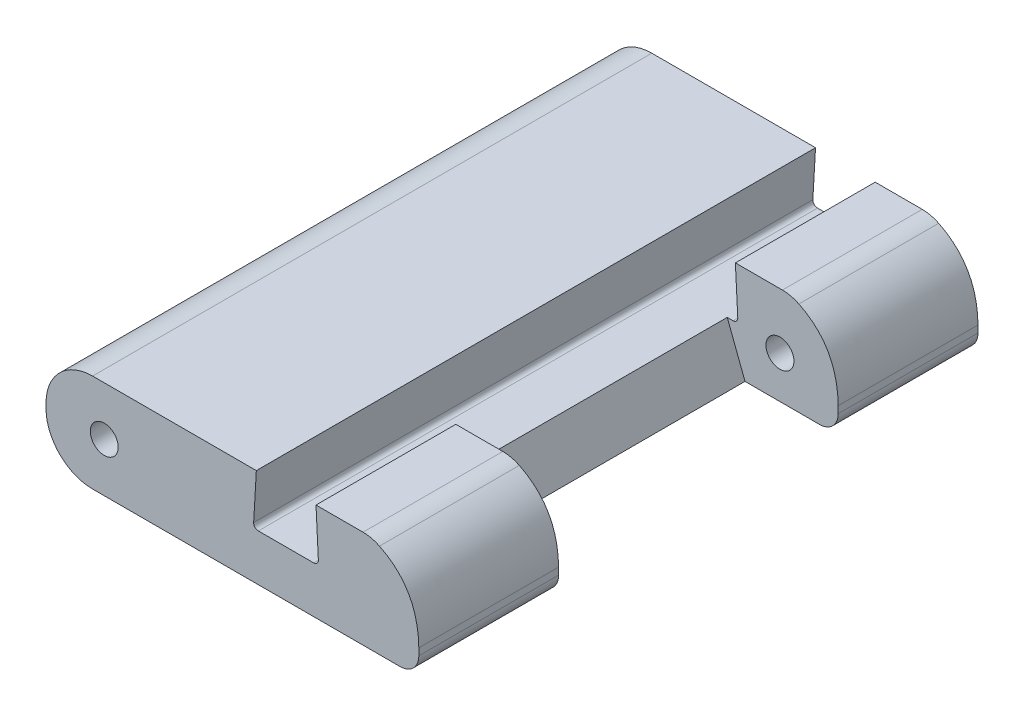
ISO-10303-21;
HEADER;
FILE_DESCRIPTION(('STEP AP214'),'2;1');
FILE_NAME('part.step','',(''),(''),'','','');
FILE_SCHEMA(('AUTOMOTIVE_DESIGN { 1 0 10303 214 1 1 1 1 }'));
ENDSEC;
DATA;
#1=APPLICATION_CONTEXT('core data for automotive mechanical design processes');
#2=APPLICATION_PROTOCOL_DEFINITION('international standard','automotive_design',2000,#1);
#3=PRODUCT_CONTEXT('',#1,'mechanical');
#4=PRODUCT('Part','Part','',(#3));
#5=PRODUCT_RELATED_PRODUCT_CATEGORY('part','',(#4));
#6=PRODUCT_DEFINITION_FORMATION('','',#4);
#7=PRODUCT_DEFINITION_CONTEXT('part definition',#1,'design');
#8=PRODUCT_DEFINITION('design','',#6,#7);
#9=PRODUCT_DEFINITION_SHAPE('','',#8);
#10=(LENGTH_UNIT() NAMED_UNIT(*) SI_UNIT(.MILLI.,.METRE.));
#11=(NAMED_UNIT(*) PLANE_ANGLE_UNIT() SI_UNIT($,.RADIAN.));
#12=(NAMED_UNIT(*) SI_UNIT($,.STERADIAN.) SOLID_ANGLE_UNIT());
#13=UNCERTAINTY_MEASURE_WITH_UNIT(LENGTH_MEASURE(1.E-05),#10,'distance_accuracy_value','');
#14=(GEOMETRIC_REPRESENTATION_CONTEXT(3) GLOBAL_UNCERTAINTY_ASSIGNED_CONTEXT((#13)) GLOBAL_UNIT_ASSIGNED_CONTEXT((#10,
#11,#12)) REPRESENTATION_CONTEXT('',''));
#15=CARTESIAN_POINT('',(0.,0.,0.));
#16=DIRECTION('',(0.,0.,1.));
#17=DIRECTION('',(1.,0.,0.));
#18=AXIS2_PLACEMENT_3D('',#15,#16,#17);
#19=CARTESIAN_POINT('',(0.,2.1,-12.));
#20=DIRECTION('',(0.,-1.,0.));
#21=DIRECTION('',(0.,0.,-1.));
#22=AXIS2_PLACEMENT_3D('',#19,#20,#21);
#23=PLANE('',#22);
#24=DIRECTION('',(1.,0.,0.));
#25=VECTOR('',#24,1.);
#26=CARTESIAN_POINT('',(0.,2.1,0.));
#27=LINE('',#26,#25);
#28=CARTESIAN_POINT('',(5.79368218827693,2.1,0.));
#29=VERTEX_POINT('',#28);
#30=CARTESIAN_POINT('',(6.80312630198546,2.1,0.));
#31=VERTEX_POINT('',#30);
#32=EDGE_CURVE('E324',#29,#31,#27,.T.);
#33=ORIENTED_EDGE('',*,*,#32,.T.);
#34=DIRECTION('',(0.,0.,1.));
#35=VECTOR('',#34,1.);
#36=CARTESIAN_POINT('',(6.80312630198546,2.1,-3.));
#37=LINE('',#36,#35);
#38=CARTESIAN_POINT('',(6.80312630198546,2.1,-3.));
#39=VERTEX_POINT('',#38);
#40=EDGE_CURVE('E418',#31,#39,#37,.F.);
#41=ORIENTED_EDGE('',*,*,#40,.T.);
#42=DIRECTION('',(1.,0.,0.));
#43=VECTOR('',#42,1.);
#44=CARTESIAN_POINT('',(8.,2.1,-3.));
#45=LINE('',#44,#43);
#46=CARTESIAN_POINT('',(5.79368218827693,2.1,-3.));
#47=VERTEX_POINT('',#46);
#48=EDGE_CURVE('E312',#47,#39,#45,.T.);
#49=ORIENTED_EDGE('',*,*,#48,.F.);
#50=DIRECTION('',(0.,0.,1.));
#51=VECTOR('',#50,1.);
#52=CARTESIAN_POINT('',(5.79368218827693,2.1,-12.));
#53=LINE('',#52,#51);
#54=EDGE_CURVE('E343',#47,#29,#53,.T.);
#55=ORIENTED_EDGE('',*,*,#54,.T.);
#56=EDGE_LOOP('',(#33,#41,#49,#55));
#57=FACE_BOUND('',#56,.T.);
#58=ADVANCED_FACE('F30',(#57),#23,.F.);
#59=DIRECTION('',(-1.,0.,0.));
#60=VECTOR('',#59,1.);
#61=CARTESIAN_POINT('',(8.,2.1,-9.));
#62=LINE('',#61,#60);
#63=CARTESIAN_POINT('',(6.80312630198546,2.1,-9.));
#64=VERTEX_POINT('',#63);
#65=CARTESIAN_POINT('',(5.79368218827693,2.1,-9.));
#66=VERTEX_POINT('',#65);
#67=EDGE_CURVE('E308',#64,#66,#62,.T.);
#68=ORIENTED_EDGE('',*,*,#67,.F.);
#69=DIRECTION('',(0.,0.,1.));
#70=VECTOR('',#69,1.);
#71=CARTESIAN_POINT('',(6.80312630198546,2.1,-12.));
#72=LINE('',#71,#70);
#73=CARTESIAN_POINT('',(6.80312630198546,2.1,-12.));
#74=VERTEX_POINT('',#73);
#75=EDGE_CURVE('E206',#64,#74,#72,.F.);
#76=ORIENTED_EDGE('',*,*,#75,.T.);
#77=DIRECTION('',(-1.,0.,0.));
#78=VECTOR('',#77,1.);
#79=CARTESIAN_POINT('',(0.,2.1,-12.));
#80=LINE('',#79,#78);
#81=CARTESIAN_POINT('',(5.79368218827693,2.1,-12.));
#82=VERTEX_POINT('',#81);
#83=EDGE_CURVE('E325',#74,#82,#80,.T.);
#84=ORIENTED_EDGE('',*,*,#83,.T.);
#85=EDGE_CURVE('E344',#82,#66,#53,.T.);
#86=ORIENTED_EDGE('',*,*,#85,.T.);
#87=EDGE_LOOP('',(#68,#76,#84,#86));
#88=FACE_BOUND('',#87,.T.);
#89=ADVANCED_FACE('F445',(#88),#23,.F.);
#90=CARTESIAN_POINT('',(0.,2.1,0.));
#91=DIRECTION('',(0.,0.,-1.));
#92=DIRECTION('',(-1.,0.,0.));
#93=AXIS2_PLACEMENT_3D('',#90,#91,#92);
#94=PLANE('',#93);
#95=CARTESIAN_POINT('',(1.25,1.05,0.));
#96=DIRECTION('',(0.,0.,1.));
#97=DIRECTION('',(1.,0.,0.));
#98=AXIS2_PLACEMENT_3D('',#95,#96,#97);
#99=CIRCLE('',#98,0.3);
#100=CARTESIAN_POINT('',(1.55,1.05,0.));
#101=VERTEX_POINT('',#100);
#102=EDGE_CURVE('E230',#101,#101,#99,.T.);
#103=ORIENTED_EDGE('',*,*,#102,.F.);
#104=EDGE_LOOP('',(#103));
#105=FACE_BOUND('',#104,.T.);
#106=CARTESIAN_POINT('',(6.96336502613804,2.1,0.));
#107=CARTESIAN_POINT('',(8.01595103083677,1.71469381853398,0.));
#108=CARTESIAN_POINT('',(8.,0.476345857940428,0.));
#109=B_SPLINE_CURVE_WITH_KNOTS('',2,(#106,#107,#108),.UNSPECIFIED.,.F.,.F.,(3,3),(0.,1.),.UNSPECIFIED.);
#110=CARTESIAN_POINT('',(7.15661174138288,2.01766847787381,0.));
#111=VERTEX_POINT('',#110);
#112=CARTESIAN_POINT('',(8.,0.549529298555272,0.));
#113=VERTEX_POINT('',#112);
#114=EDGE_CURVE('E252',#111,#113,#109,.T.);
#115=ORIENTED_EDGE('',*,*,#114,.F.);
#116=CARTESIAN_POINT('',(6.80312630198546,1.29999999999958,0.));
#117=DIRECTION('',(0.,0.,-1.));
#118=DIRECTION('',(-1.,0.,0.));
#119=AXIS2_PLACEMENT_3D('',#116,#117,#118);
#120=CIRCLE('',#119,0.8);
#121=EDGE_CURVE('E11',#111,#31,#120,.F.);
#122=ORIENTED_EDGE('',*,*,#121,.T.);
#123=ORIENTED_EDGE('',*,*,#32,.F.);
#124=DIRECTION('',(0.0511310412437179,-0.99869195281695,0.));
#125=VECTOR('',#124,1.);
#126=CARTESIAN_POINT('',(5.77853528186262,2.39584951094459,0.));
#127=LINE('',#126,#125);
#128=CARTESIAN_POINT('',(5.84461841817482,1.10511310412437,0.));
#129=VERTEX_POINT('',#128);
#130=EDGE_CURVE('E296',#29,#129,#127,.T.);
#131=ORIENTED_EDGE('',*,*,#130,.T.);
#132=CARTESIAN_POINT('',(5.74474922289312,1.1,0.));
#133=DIRECTION('',(0.,0.,-1.));
#134=DIRECTION('',(-1.,0.,0.));
#135=AXIS2_PLACEMENT_3D('',#132,#133,#134);
#136=CIRCLE('',#135,0.1);
#137=CARTESIAN_POINT('',(5.74474922289312,1.,0.));
#138=VERTEX_POINT('',#137);
#139=EDGE_CURVE('E305',#129,#138,#136,.T.);
#140=ORIENTED_EDGE('',*,*,#139,.T.);
#141=DIRECTION('',(-1.,0.,0.));
#142=VECTOR('',#141,1.);
#143=CARTESIAN_POINT('',(0.,1.,0.));
#144=LINE('',#143,#142);
#145=CARTESIAN_POINT('',(4.55594571938791,1.,0.));
#146=VERTEX_POINT('',#145);
#147=EDGE_CURVE('E302',#138,#146,#144,.T.);
#148=ORIENTED_EDGE('',*,*,#147,.T.);
#149=CARTESIAN_POINT('',(4.55594571938791,1.1,0.));
#150=DIRECTION('',(0.,0.,-1.));
#151=DIRECTION('',(-1.,0.,0.));
#152=AXIS2_PLACEMENT_3D('',#149,#150,#151);
#153=CIRCLE('',#152,0.1);
#154=CARTESIAN_POINT('',(4.45611227966781,1.10576925590116,0.));
#155=VERTEX_POINT('',#154);
#156=EDGE_CURVE('E299',#146,#155,#153,.T.);
#157=ORIENTED_EDGE('',*,*,#156,.T.);
#158=DIRECTION('',(0.0576925590115498,0.998334397201008,0.));
#159=VECTOR('',#158,1.);
#160=CARTESIAN_POINT('',(4.49854459316057,1.84003445124735,0.));
#161=LINE('',#160,#159);
#162=CARTESIAN_POINT('',(4.51356769344082,2.1,0.));
#163=VERTEX_POINT('',#162);
#164=EDGE_CURVE('E290',#155,#163,#161,.T.);
#165=ORIENTED_EDGE('',*,*,#164,.T.);
#166=CARTESIAN_POINT('',(1.,2.1,0.));
#167=VERTEX_POINT('',#166);
#168=EDGE_CURVE('E321',#167,#163,#27,.T.);
#169=ORIENTED_EDGE('',*,*,#168,.F.);
#170=CARTESIAN_POINT('',(1.,1.1,0.));
#171=DIRECTION('',(0.,0.,-1.));
#172=DIRECTION('',(-1.,0.,0.));
#173=AXIS2_PLACEMENT_3D('',#170,#171,#172);
#174=CIRCLE('',#173,1.);
#175=CARTESIAN_POINT('',(0.,1.1,0.));
#176=VERTEX_POINT('',#175);
#177=EDGE_CURVE('E371',#167,#176,#174,.F.);
#178=ORIENTED_EDGE('',*,*,#177,.T.);
#179=DIRECTION('',(0.,-1.,0.));
#180=VECTOR('',#179,1.);
#181=CARTESIAN_POINT('',(0.,2.1,0.));
#182=LINE('',#181,#180);
#183=CARTESIAN_POINT('',(0.,1.,0.));
#184=VERTEX_POINT('',#183);
#185=EDGE_CURVE('E337',#176,#184,#182,.T.);
#186=ORIENTED_EDGE('',*,*,#185,.T.);
#187=CARTESIAN_POINT('',(1.,1.,0.));
#188=DIRECTION('',(0.,0.,-1.));
#189=DIRECTION('',(-1.,0.,0.));
#190=AXIS2_PLACEMENT_3D('',#187,#188,#189);
#191=CIRCLE('',#190,1.);
#192=CARTESIAN_POINT('',(1.,0.,0.));
#193=VERTEX_POINT('',#192);
#194=EDGE_CURVE('E373',#184,#193,#191,.F.);
#195=ORIENTED_EDGE('',*,*,#194,.T.);
#196=DIRECTION('',(1.,0.,0.));
#197=VECTOR('',#196,1.);
#198=CARTESIAN_POINT('',(0.,0.,0.));
#199=LINE('',#198,#197);
#200=CARTESIAN_POINT('',(7.6,0.,0.));
#201=VERTEX_POINT('',#200);
#202=EDGE_CURVE('E319',#193,#201,#199,.T.);
#203=ORIENTED_EDGE('',*,*,#202,.T.);
#204=CARTESIAN_POINT('',(7.6,0.4,0.));
#205=DIRECTION('',(0.,0.,-1.));
#206=DIRECTION('',(-1.,0.,0.));
#207=AXIS2_PLACEMENT_3D('',#204,#205,#206);
#208=CIRCLE('',#207,0.4);
#209=CARTESIAN_POINT('',(8.,0.4,0.));
#210=VERTEX_POINT('',#209);
#211=EDGE_CURVE('E207',#201,#210,#208,.F.);
#212=ORIENTED_EDGE('',*,*,#211,.T.);
#213=DIRECTION('',(0.,-1.,0.));
#214=VECTOR('',#213,1.);
#215=CARTESIAN_POINT('',(8.,2.1,0.));
#216=LINE('',#215,#214);
#217=EDGE_CURVE('E335',#113,#210,#216,.T.);
#218=ORIENTED_EDGE('',*,*,#217,.F.);
#219=EDGE_LOOP('',(#115,#122,#123,#131,#140,#148,#157,#165,#169,#178,#186,#195,#203,#212,#218));
#220=FACE_BOUND('',#219,.T.);
#221=ADVANCED_FACE('F435',(#105,#220),#94,.F.);
#222=CARTESIAN_POINT('',(0.,2.1,-12.));
#223=DIRECTION('',(0.,0.,1.));
#224=DIRECTION('',(1.,0.,0.));
#225=AXIS2_PLACEMENT_3D('',#222,#223,#224);
#226=PLANE('',#225);
#227=CARTESIAN_POINT('',(6.75,0.9,-12.));
#228=DIRECTION('',(0.,0.,-1.));
#229=DIRECTION('',(-1.,0.,0.));
#230=AXIS2_PLACEMENT_3D('',#227,#228,#229);
#231=CIRCLE('',#230,0.3);
#232=CARTESIAN_POINT('',(6.45,0.9,-12.));
#233=VERTEX_POINT('',#232);
#234=EDGE_CURVE('E590',#233,#233,#231,.T.);
#235=ORIENTED_EDGE('',*,*,#234,.F.);
#236=EDGE_LOOP('',(#235));
#237=FACE_BOUND('',#236,.T.);
#238=CARTESIAN_POINT('',(1.25,1.05,-12.));
#239=DIRECTION('',(0.,0.,1.));
#240=DIRECTION('',(1.,0.,0.));
#241=AXIS2_PLACEMENT_3D('',#238,#239,#240);
#242=CIRCLE('',#241,0.3);
#243=CARTESIAN_POINT('',(1.55,1.05,-12.));
#244=VERTEX_POINT('',#243);
#245=EDGE_CURVE('E225',#244,#244,#242,.T.);
#246=ORIENTED_EDGE('',*,*,#245,.T.);
#247=EDGE_LOOP('',(#246));
#248=FACE_BOUND('',#247,.T.);
#249=ORIENTED_EDGE('',*,*,#83,.F.);
#250=CARTESIAN_POINT('',(6.80312630198546,1.29999999999958,-12.));
#251=DIRECTION('',(0.,0.,1.));
#252=DIRECTION('',(1.,0.,0.));
#253=AXIS2_PLACEMENT_3D('',#250,#251,#252);
#254=CIRCLE('',#253,0.8);
#255=CARTESIAN_POINT('',(7.15661174138288,2.01766847787381,-12.));
#256=VERTEX_POINT('',#255);
#257=EDGE_CURVE('E413',#74,#256,#254,.F.);
#258=ORIENTED_EDGE('',*,*,#257,.T.);
#259=CARTESIAN_POINT('',(6.96336502613804,2.1,-12.));
#260=CARTESIAN_POINT('',(8.01595103083677,1.71469381853398,-12.));
#261=CARTESIAN_POINT('',(8.,0.476345857940428,-12.));
#262=B_SPLINE_CURVE_WITH_KNOTS('',2,(#259,#260,#261),.UNSPECIFIED.,.F.,.F.,(3,3),(0.,1.),.UNSPECIFIED.);
#263=CARTESIAN_POINT('',(8.,0.549529298555272,-12.));
#264=VERTEX_POINT('',#263);
#265=EDGE_CURVE('E224',#264,#256,#262,.F.);
#266=ORIENTED_EDGE('',*,*,#265,.F.);
#267=DIRECTION('',(0.,-1.,0.));
#268=VECTOR('',#267,1.);
#269=CARTESIAN_POINT('',(8.,2.1,-12.));
#270=LINE('',#269,#268);
#271=CARTESIAN_POINT('',(8.,0.4,-12.));
#272=VERTEX_POINT('',#271);
#273=EDGE_CURVE('E223',#264,#272,#270,.T.);
#274=ORIENTED_EDGE('',*,*,#273,.T.);
#275=CARTESIAN_POINT('',(7.6,0.4,-12.));
#276=DIRECTION('',(0.,0.,1.));
#277=DIRECTION('',(1.,0.,0.));
#278=AXIS2_PLACEMENT_3D('',#275,#276,#277);
#279=CIRCLE('',#278,0.4);
#280=CARTESIAN_POINT('',(7.6,0.,-12.));
#281=VERTEX_POINT('',#280);
#282=EDGE_CURVE('E387',#272,#281,#279,.F.);
#283=ORIENTED_EDGE('',*,*,#282,.T.);
#284=DIRECTION('',(-1.,0.,0.));
#285=VECTOR('',#284,1.);
#286=CARTESIAN_POINT('',(0.,0.,-12.));
#287=LINE('',#286,#285);
#288=CARTESIAN_POINT('',(1.,0.,-12.));
#289=VERTEX_POINT('',#288);
#290=EDGE_CURVE('E330',#281,#289,#287,.T.);
#291=ORIENTED_EDGE('',*,*,#290,.T.);
#292=CARTESIAN_POINT('',(1.,1.,-12.));
#293=DIRECTION('',(0.,0.,1.));
#294=DIRECTION('',(1.,0.,0.));
#295=AXIS2_PLACEMENT_3D('',#292,#293,#294);
#296=CIRCLE('',#295,1.);
#297=CARTESIAN_POINT('',(0.,1.,-12.));
#298=VERTEX_POINT('',#297);
#299=EDGE_CURVE('E380',#289,#298,#296,.F.);
#300=ORIENTED_EDGE('',*,*,#299,.T.);
#301=DIRECTION('',(0.,-1.,0.));
#302=VECTOR('',#301,1.);
#303=CARTESIAN_POINT('',(0.,2.1,-12.));
#304=LINE('',#303,#302);
#305=CARTESIAN_POINT('',(0.,1.1,-12.));
#306=VERTEX_POINT('',#305);
#307=EDGE_CURVE('E327',#306,#298,#304,.T.);
#308=ORIENTED_EDGE('',*,*,#307,.F.);
#309=CARTESIAN_POINT('',(1.,1.1,-12.));
#310=DIRECTION('',(0.,0.,1.));
#311=DIRECTION('',(1.,0.,0.));
#312=AXIS2_PLACEMENT_3D('',#309,#310,#311);
#313=CIRCLE('',#312,1.);
#314=CARTESIAN_POINT('',(1.,2.1,-12.));
#315=VERTEX_POINT('',#314);
#316=EDGE_CURVE('E378',#306,#315,#313,.F.);
#317=ORIENTED_EDGE('',*,*,#316,.T.);
#318=CARTESIAN_POINT('',(4.51356769344082,2.1,-12.));
#319=VERTEX_POINT('',#318);
#320=EDGE_CURVE('E323',#319,#315,#80,.T.);
#321=ORIENTED_EDGE('',*,*,#320,.F.);
#322=DIRECTION('',(-0.0576925590115498,-0.998334397201008,0.));
#323=VECTOR('',#322,1.);
#324=CARTESIAN_POINT('',(4.49854459316057,1.84003445124735,-12.));
#325=LINE('',#324,#323);
#326=CARTESIAN_POINT('',(4.45611227966781,1.10576925590116,-12.));
#327=VERTEX_POINT('',#326);
#328=EDGE_CURVE('E287',#319,#327,#325,.T.);
#329=ORIENTED_EDGE('',*,*,#328,.T.);
#330=CARTESIAN_POINT('',(4.55594571938791,1.1,-12.));
#331=DIRECTION('',(0.,0.,1.));
#332=DIRECTION('',(1.,0.,0.));
#333=AXIS2_PLACEMENT_3D('',#330,#331,#332);
#334=CIRCLE('',#333,0.1);
#335=CARTESIAN_POINT('',(4.55594571938791,1.,-12.));
#336=VERTEX_POINT('',#335);
#337=EDGE_CURVE('E347',#327,#336,#334,.T.);
#338=ORIENTED_EDGE('',*,*,#337,.T.);
#339=DIRECTION('',(1.,0.,0.));
#340=VECTOR('',#339,1.);
#341=CARTESIAN_POINT('',(0.,1.,-12.));
#342=LINE('',#341,#340);
#343=CARTESIAN_POINT('',(5.74474922289312,1.,-12.));
#344=VERTEX_POINT('',#343);
#345=EDGE_CURVE('E350',#336,#344,#342,.T.);
#346=ORIENTED_EDGE('',*,*,#345,.T.);
#347=CARTESIAN_POINT('',(5.74474922289312,1.1,-12.));
#348=DIRECTION('',(0.,0.,1.));
#349=DIRECTION('',(1.,0.,0.));
#350=AXIS2_PLACEMENT_3D('',#347,#348,#349);
#351=CIRCLE('',#350,0.1);
#352=CARTESIAN_POINT('',(5.84461841817482,1.10511310412437,-12.));
#353=VERTEX_POINT('',#352);
#354=EDGE_CURVE('E353',#344,#353,#351,.T.);
#355=ORIENTED_EDGE('',*,*,#354,.T.);
#356=DIRECTION('',(-0.0511310412437179,0.99869195281695,0.));
#357=VECTOR('',#356,1.);
#358=CARTESIAN_POINT('',(5.77853528186262,2.39584951094459,-12.));
#359=LINE('',#358,#357);
#360=EDGE_CURVE('E293',#353,#82,#359,.T.);
#361=ORIENTED_EDGE('',*,*,#360,.T.);
#362=EDGE_LOOP('',(#249,#258,#266,#274,#283,#291,#300,#308,#317,#321,#329,#338,#346,#355,#361));
#363=FACE_BOUND('',#362,.T.);
#364=ADVANCED_FACE('F515',(#237,#248,#363),#226,.F.);
#365=CARTESIAN_POINT('',(8.,0.,-3.));
#366=DIRECTION('',(0.,0.,1.));
#367=DIRECTION('',(1.,0.,0.));
#368=AXIS2_PLACEMENT_3D('',#365,#366,#367);
#369=PLANE('',#368);
#370=CARTESIAN_POINT('',(6.75,0.9,-3.));
#371=DIRECTION('',(0.,0.,1.));
#372=DIRECTION('',(1.,0.,0.));
#373=AXIS2_PLACEMENT_3D('',#370,#371,#372);
#374=CIRCLE('',#373,0.3);
#375=CARTESIAN_POINT('',(7.05,0.9,-3.));
#376=VERTEX_POINT('',#375);
#377=EDGE_CURVE('E409',#376,#376,#374,.T.);
#378=ORIENTED_EDGE('',*,*,#377,.T.);
#379=EDGE_LOOP('',(#378));
#380=FACE_BOUND('',#379,.T.);
#381=ORIENTED_EDGE('',*,*,#48,.T.);
#382=CARTESIAN_POINT('',(6.80312630198546,1.29999999999958,-3.));
#383=DIRECTION('',(0.,0.,1.));
#384=DIRECTION('',(1.,0.,0.));
#385=AXIS2_PLACEMENT_3D('',#382,#383,#384);
#386=CIRCLE('',#385,0.8);
#387=CARTESIAN_POINT('',(7.15661174138288,2.01766847787381,-3.));
#388=VERTEX_POINT('',#387);
#389=EDGE_CURVE('E52',#39,#388,#386,.F.);
#390=ORIENTED_EDGE('',*,*,#389,.T.);
#391=CARTESIAN_POINT('',(6.96336502613804,2.1,-3.));
#392=CARTESIAN_POINT('',(8.01595103083677,1.71469381853398,-3.));
#393=CARTESIAN_POINT('',(8.,0.476345857940428,-3.));
#394=B_SPLINE_CURVE_WITH_KNOTS('',2,(#391,#392,#393),.UNSPECIFIED.,.F.,.F.,(3,3),(0.,1.),.UNSPECIFIED.);
#395=CARTESIAN_POINT('',(8.,0.549529298555272,-3.));
#396=VERTEX_POINT('',#395);
#397=EDGE_CURVE('E227',#396,#388,#394,.F.);
#398=ORIENTED_EDGE('',*,*,#397,.F.);
#399=DIRECTION('',(0.,1.,0.));
#400=VECTOR('',#399,1.);
#401=CARTESIAN_POINT('',(8.,0.,-3.));
#402=LINE('',#401,#400);
#403=CARTESIAN_POINT('',(8.,0.4,-3.));
#404=VERTEX_POINT('',#403);
#405=EDGE_CURVE('E218',#404,#396,#402,.T.);
#406=ORIENTED_EDGE('',*,*,#405,.F.);
#407=CARTESIAN_POINT('',(7.6,0.4,-3.));
#408=DIRECTION('',(0.,0.,1.));
#409=DIRECTION('',(1.,0.,0.));
#410=AXIS2_PLACEMENT_3D('',#407,#408,#409);
#411=CIRCLE('',#410,0.4);
#412=CARTESIAN_POINT('',(7.6,0.,-3.));
#413=VERTEX_POINT('',#412);
#414=EDGE_CURVE('E397',#404,#413,#411,.F.);
#415=ORIENTED_EDGE('',*,*,#414,.T.);
#416=DIRECTION('',(1.,0.,0.));
#417=VECTOR('',#416,1.);
#418=CARTESIAN_POINT('',(8.,0.,-3.));
#419=LINE('',#418,#417);
#420=CARTESIAN_POINT('',(6.,0.,-3.));
#421=VERTEX_POINT('',#420);
#422=EDGE_CURVE('E219',#421,#413,#419,.T.);
#423=ORIENTED_EDGE('',*,*,#422,.F.);
#424=DIRECTION('',(0.355992482891917,-0.934488818619275,0.));
#425=VECTOR('',#424,1.);
#426=CARTESIAN_POINT('',(5.61905110494751,1.,-3.));
#427=LINE('',#426,#425);
#428=CARTESIAN_POINT('',(5.61905110494751,1.,-3.));
#429=VERTEX_POINT('',#428);
#430=EDGE_CURVE('E257',#429,#421,#427,.T.);
#431=ORIENTED_EDGE('',*,*,#430,.F.);
#432=DIRECTION('',(1.,0.,0.));
#433=VECTOR('',#432,1.);
#434=CARTESIAN_POINT('',(5.74474922289312,1.,-3.));
#435=LINE('',#434,#433);
#436=CARTESIAN_POINT('',(5.74474922289312,1.,-3.));
#437=VERTEX_POINT('',#436);
#438=EDGE_CURVE('E364',#429,#437,#435,.T.);
#439=ORIENTED_EDGE('',*,*,#438,.T.);
#440=CARTESIAN_POINT('',(5.74474922289312,1.1,-3.));
#441=DIRECTION('',(0.,0.,1.));
#442=DIRECTION('',(1.,0.,0.));
#443=AXIS2_PLACEMENT_3D('',#440,#441,#442);
#444=CIRCLE('',#443,0.1);
#445=CARTESIAN_POINT('',(5.84461841817482,1.10511310412437,-3.));
#446=VERTEX_POINT('',#445);
#447=EDGE_CURVE('E270',#446,#437,#444,.F.);
#448=ORIENTED_EDGE('',*,*,#447,.F.);
#449=DIRECTION('',(0.0511310412437179,-0.99869195281695,0.));
#450=VECTOR('',#449,1.);
#451=CARTESIAN_POINT('',(5.79368218827693,2.1,-3.));
#452=LINE('',#451,#450);
#453=EDGE_CURVE('E359',#47,#446,#452,.T.);
#454=ORIENTED_EDGE('',*,*,#453,.F.);
#455=EDGE_LOOP('',(#381,#390,#398,#406,#415,#423,#431,#439,#448,#454));
#456=FACE_BOUND('',#455,.T.);
#457=ADVANCED_FACE('F428',(#380,#456),#369,.F.);
#458=CARTESIAN_POINT('',(8.,0.,-9.));
#459=DIRECTION('',(0.,0.,-1.));
#460=DIRECTION('',(-1.,0.,0.));
#461=AXIS2_PLACEMENT_3D('',#458,#459,#460);
#462=PLANE('',#461);
#463=CARTESIAN_POINT('',(6.75,0.9,-9.));
#464=DIRECTION('',(0.,0.,-1.));
#465=DIRECTION('',(-1.,0.,0.));
#466=AXIS2_PLACEMENT_3D('',#463,#464,#465);
#467=CIRCLE('',#466,0.3);
#468=CARTESIAN_POINT('',(6.45,0.9,-9.));
#469=VERTEX_POINT('',#468);
#470=EDGE_CURVE('E403',#469,#469,#467,.T.);
#471=ORIENTED_EDGE('',*,*,#470,.T.);
#472=EDGE_LOOP('',(#471));
#473=FACE_BOUND('',#472,.T.);
#474=CARTESIAN_POINT('',(6.96336502613804,2.1,-9.));
#475=CARTESIAN_POINT('',(8.01595103083677,1.71469381853398,-9.));
#476=CARTESIAN_POINT('',(8.,0.476345857940428,-9.));
#477=B_SPLINE_CURVE_WITH_KNOTS('',2,(#474,#475,#476),.UNSPECIFIED.,.F.,.F.,(3,3),(0.,1.),.UNSPECIFIED.);
#478=CARTESIAN_POINT('',(7.15661174138288,2.01766847787382,-9.));
#479=VERTEX_POINT('',#478);
#480=CARTESIAN_POINT('',(7.9999999999873,0.549529298555105,-9.));
#481=VERTEX_POINT('',#480);
#482=EDGE_CURVE('E196',#479,#481,#477,.T.);
#483=ORIENTED_EDGE('',*,*,#482,.F.);
#484=CARTESIAN_POINT('',(6.80312630198546,1.29999999999958,-9.));
#485=DIRECTION('',(0.,0.,-1.));
#486=DIRECTION('',(-1.,0.,0.));
#487=AXIS2_PLACEMENT_3D('',#484,#485,#486);
#488=CIRCLE('',#487,0.8);
#489=EDGE_CURVE('E416',#479,#64,#488,.F.);
#490=ORIENTED_EDGE('',*,*,#489,.T.);
#491=ORIENTED_EDGE('',*,*,#67,.T.);
#492=DIRECTION('',(-0.0511310412437179,0.99869195281695,0.));
#493=VECTOR('',#492,1.);
#494=CARTESIAN_POINT('',(5.79368218827693,2.1,-9.));
#495=LINE('',#494,#493);
#496=CARTESIAN_POINT('',(5.84461841817482,1.10511310412437,-9.));
#497=VERTEX_POINT('',#496);
#498=EDGE_CURVE('E356',#497,#66,#495,.T.);
#499=ORIENTED_EDGE('',*,*,#498,.F.);
#500=CARTESIAN_POINT('',(5.74474922289312,1.1,-9.));
#501=DIRECTION('',(0.,0.,-1.));
#502=DIRECTION('',(-1.,0.,0.));
#503=AXIS2_PLACEMENT_3D('',#500,#501,#502);
#504=CIRCLE('',#503,0.1);
#505=CARTESIAN_POINT('',(5.74474922289312,1.,-9.));
#506=VERTEX_POINT('',#505);
#507=EDGE_CURVE('E267',#506,#497,#504,.F.);
#508=ORIENTED_EDGE('',*,*,#507,.F.);
#509=DIRECTION('',(1.,0.,0.));
#510=VECTOR('',#509,1.);
#511=CARTESIAN_POINT('',(5.74474922289312,1.,-9.));
#512=LINE('',#511,#510);
#513=CARTESIAN_POINT('',(5.61905110494751,1.,-9.));
#514=VERTEX_POINT('',#513);
#515=EDGE_CURVE('E362',#514,#506,#512,.T.);
#516=ORIENTED_EDGE('',*,*,#515,.F.);
#517=DIRECTION('',(0.355992482891917,-0.934488818619275,0.));
#518=VECTOR('',#517,1.);
#519=CARTESIAN_POINT('',(5.61905110494751,1.,-9.));
#520=LINE('',#519,#518);
#521=CARTESIAN_POINT('',(6.,0.,-9.));
#522=VERTEX_POINT('',#521);
#523=EDGE_CURVE('E256',#514,#522,#520,.T.);
#524=ORIENTED_EDGE('',*,*,#523,.T.);
#525=DIRECTION('',(-1.,0.,0.));
#526=VECTOR('',#525,1.);
#527=CARTESIAN_POINT('',(8.,0.,-9.));
#528=LINE('',#527,#526);
#529=CARTESIAN_POINT('',(7.6,0.,-9.));
#530=VERTEX_POINT('',#529);
#531=EDGE_CURVE('E309',#530,#522,#528,.T.);
#532=ORIENTED_EDGE('',*,*,#531,.F.);
#533=CARTESIAN_POINT('',(7.6,0.4,-9.));
#534=DIRECTION('',(0.,0.,-1.));
#535=DIRECTION('',(-1.,0.,0.));
#536=AXIS2_PLACEMENT_3D('',#533,#534,#535);
#537=CIRCLE('',#536,0.4);
#538=CARTESIAN_POINT('',(8.,0.4,-9.));
#539=VERTEX_POINT('',#538);
#540=EDGE_CURVE('E214',#530,#539,#537,.F.);
#541=ORIENTED_EDGE('',*,*,#540,.T.);
#542=DIRECTION('',(0.,1.,0.));
#543=VECTOR('',#542,1.);
#544=CARTESIAN_POINT('',(8.,0.,-9.));
#545=LINE('',#544,#543);
#546=EDGE_CURVE('E210',#539,#481,#545,.T.);
#547=ORIENTED_EDGE('',*,*,#546,.T.);
#548=EDGE_LOOP('',(#483,#490,#491,#499,#508,#516,#524,#532,#541,#547));
#549=FACE_BOUND('',#548,.T.);
#550=ADVANCED_FACE('F211',(#473,#549),#462,.F.);
#551=CARTESIAN_POINT('',(5.74474922289312,1.,21.9678655445692));
#552=DIRECTION('',(0.,-1.,0.));
#553=DIRECTION('',(0.,0.,-1.));
#554=AXIS2_PLACEMENT_3D('',#551,#552,#553);
#555=PLANE('',#554);
#556=ORIENTED_EDGE('',*,*,#438,.F.);
#557=DIRECTION('',(0.,0.,-1.));
#558=VECTOR('',#557,1.);
#559=CARTESIAN_POINT('',(5.61905110494751,1.,-3.));
#560=LINE('',#559,#558);
#561=EDGE_CURVE('E262',#429,#514,#560,.T.);
#562=ORIENTED_EDGE('',*,*,#561,.T.);
#563=ORIENTED_EDGE('',*,*,#515,.T.);
#564=DIRECTION('',(0.,0.,-1.));
#565=VECTOR('',#564,1.);
#566=CARTESIAN_POINT('',(5.74474922289312,1.,21.9678655445692));
#567=LINE('',#566,#565);
#568=EDGE_CURVE('E279',#506,#344,#567,.T.);
#569=ORIENTED_EDGE('',*,*,#568,.T.);
#570=ORIENTED_EDGE('',*,*,#345,.F.);
#571=DIRECTION('',(0.,0.,-1.));
#572=VECTOR('',#571,1.);
#573=CARTESIAN_POINT('',(4.55594571938791,1.,21.9678655445692));
#574=LINE('',#573,#572);
#575=EDGE_CURVE('E276',#146,#336,#574,.T.);
#576=ORIENTED_EDGE('',*,*,#575,.F.);
#577=ORIENTED_EDGE('',*,*,#147,.F.);
#578=EDGE_CURVE('E280',#138,#437,#567,.T.);
#579=ORIENTED_EDGE('',*,*,#578,.T.);
#580=EDGE_LOOP('',(#556,#562,#563,#569,#570,#576,#577,#579));
#581=FACE_BOUND('',#580,.T.);
#582=ADVANCED_FACE('F505',(#581),#555,.F.);
#583=CARTESIAN_POINT('',(5.74474922289312,1.1,21.9678655445692));
#584=DIRECTION('',(0.,0.,-1.));
#585=DIRECTION('',(-1.,0.,0.));
#586=AXIS2_PLACEMENT_3D('',#583,#584,#585);
#587=CYLINDRICAL_SURFACE('',#586,0.1);
#588=DIRECTION('',(0.,0.,-1.));
#589=VECTOR('',#588,1.);
#590=CARTESIAN_POINT('',(5.84461841817482,1.10511310412437,21.9678655445692));
#591=LINE('',#590,#589);
#592=EDGE_CURVE('E284',#129,#446,#591,.T.);
#593=ORIENTED_EDGE('',*,*,#592,.T.);
#594=ORIENTED_EDGE('',*,*,#447,.T.);
#595=ORIENTED_EDGE('',*,*,#578,.F.);
#596=ORIENTED_EDGE('',*,*,#139,.F.);
#597=EDGE_LOOP('',(#593,#594,#595,#596));
#598=FACE_BOUND('',#597,.T.);
#599=ADVANCED_FACE('F509',(#598),#587,.F.);
#600=CARTESIAN_POINT('',(5.79368218827693,2.1,21.9678655445692));
#601=DIRECTION('',(0.99869195281695,0.0511310412437179,0.));
#602=DIRECTION('',(-0.0511310412437179,0.99869195281695,0.));
#603=AXIS2_PLACEMENT_3D('',#600,#601,#602);
#604=PLANE('',#603);
#605=ORIENTED_EDGE('',*,*,#54,.F.);
#606=ORIENTED_EDGE('',*,*,#453,.T.);
#607=ORIENTED_EDGE('',*,*,#592,.F.);
#608=ORIENTED_EDGE('',*,*,#130,.F.);
#609=EDGE_LOOP('',(#605,#606,#607,#608));
#610=FACE_BOUND('',#609,.T.);
#611=ADVANCED_FACE('F433',(#610),#604,.F.);
#612=CARTESIAN_POINT('',(8.,2.1,0.));
#613=DIRECTION('',(-1.,0.,0.));
#614=DIRECTION('',(0.,0.,1.));
#615=AXIS2_PLACEMENT_3D('',#612,#613,#614);
#616=PLANE('',#615);
#617=ORIENTED_EDGE('',*,*,#405,.T.);
#618=DIRECTION('',(0.,0.,-1.));
#619=VECTOR('',#618,1.);
#620=CARTESIAN_POINT('',(8.,0.549529297589219,21.9678655445692));
#621=LINE('',#620,#619);
#622=EDGE_CURVE('E246',#113,#396,#621,.T.);
#623=ORIENTED_EDGE('',*,*,#622,.F.);
#624=ORIENTED_EDGE('',*,*,#217,.T.);
#625=DIRECTION('',(0.,0.,-1.));
#626=VECTOR('',#625,1.);
#627=CARTESIAN_POINT('',(8.,0.4,-3.));
#628=LINE('',#627,#626);
#629=EDGE_CURVE('E394',#210,#404,#628,.T.);
#630=ORIENTED_EDGE('',*,*,#629,.T.);
#631=EDGE_LOOP('',(#617,#623,#624,#630));
#632=FACE_BOUND('',#631,.T.);
#633=ADVANCED_FACE('F465',(#632),#616,.F.);
#634=CARTESIAN_POINT('',(0.,2.1,0.));
#635=DIRECTION('',(1.,0.,0.));
#636=DIRECTION('',(0.,0.,-1.));
#637=AXIS2_PLACEMENT_3D('',#634,#635,#636);
#638=PLANE('',#637);
#639=ORIENTED_EDGE('',*,*,#307,.T.);
#640=DIRECTION('',(0.,0.,1.));
#641=VECTOR('',#640,1.);
#642=CARTESIAN_POINT('',(0.,1.,0.));
#643=LINE('',#642,#641);
#644=EDGE_CURVE('E368',#298,#184,#643,.T.);
#645=ORIENTED_EDGE('',*,*,#644,.T.);
#646=ORIENTED_EDGE('',*,*,#185,.F.);
#647=DIRECTION('',(0.,0.,1.));
#648=VECTOR('',#647,1.);
#649=CARTESIAN_POINT('',(0.,1.1,0.));
#650=LINE('',#649,#648);
#651=EDGE_CURVE('E366',#176,#306,#650,.F.);
#652=ORIENTED_EDGE('',*,*,#651,.T.);
#653=EDGE_LOOP('',(#639,#645,#646,#652));
#654=FACE_BOUND('',#653,.T.);
#655=ADVANCED_FACE('F463',(#654),#638,.F.);
#656=DIRECTION('',(0.,0.,-1.));
#657=VECTOR('',#656,1.);
#658=CARTESIAN_POINT('',(8.,0.4,-12.));
#659=LINE('',#658,#657);
#660=EDGE_CURVE('E385',#539,#272,#659,.T.);
#661=ORIENTED_EDGE('',*,*,#660,.T.);
#662=ORIENTED_EDGE('',*,*,#273,.F.);
#663=DIRECTION('',(0.,0.,-1.));
#664=VECTOR('',#663,1.);
#665=CARTESIAN_POINT('',(8.,0.549529297589219,21.9678655445692));
#666=LINE('',#665,#664);
#667=EDGE_CURVE('E201',#481,#264,#666,.T.);
#668=ORIENTED_EDGE('',*,*,#667,.F.);
#669=ORIENTED_EDGE('',*,*,#546,.F.);
#670=EDGE_LOOP('',(#661,#662,#668,#669));
#671=FACE_BOUND('',#670,.T.);
#672=ADVANCED_FACE('F222',(#671),#616,.F.);
#673=ORIENTED_EDGE('',*,*,#320,.T.);
#674=DIRECTION('',(0.,0.,1.));
#675=VECTOR('',#674,1.);
#676=CARTESIAN_POINT('',(1.,2.1,-12.));
#677=LINE('',#676,#675);
#678=EDGE_CURVE('E382',#315,#167,#677,.T.);
#679=ORIENTED_EDGE('',*,*,#678,.T.);
#680=ORIENTED_EDGE('',*,*,#168,.T.);
#681=DIRECTION('',(0.,0.,-1.));
#682=VECTOR('',#681,1.);
#683=CARTESIAN_POINT('',(4.51356769344082,2.1,-12.));
#684=LINE('',#683,#682);
#685=EDGE_CURVE('E340',#163,#319,#684,.T.);
#686=ORIENTED_EDGE('',*,*,#685,.T.);
#687=EDGE_LOOP('',(#673,#679,#680,#686));
#688=FACE_BOUND('',#687,.T.);
#689=ADVANCED_FACE('F447',(#688),#23,.F.);
#690=CARTESIAN_POINT('',(0.,0.,-12.));
#691=DIRECTION('',(0.,-1.,0.));
#692=DIRECTION('',(0.,0.,-1.));
#693=AXIS2_PLACEMENT_3D('',#690,#691,#692);
#694=PLANE('',#693);
#695=ORIENTED_EDGE('',*,*,#290,.F.);
#696=DIRECTION('',(0.,0.,-1.));
#697=VECTOR('',#696,1.);
#698=CARTESIAN_POINT('',(7.6,0.,-9.));
#699=LINE('',#698,#697);
#700=EDGE_CURVE('E391',#281,#530,#699,.F.);
#701=ORIENTED_EDGE('',*,*,#700,.T.);
#702=ORIENTED_EDGE('',*,*,#531,.T.);
#703=DIRECTION('',(0.,0.,1.));
#704=VECTOR('',#703,1.);
#705=CARTESIAN_POINT('',(6.,0.,-3.));
#706=LINE('',#705,#704);
#707=EDGE_CURVE('E311',#522,#421,#706,.T.);
#708=ORIENTED_EDGE('',*,*,#707,.T.);
#709=ORIENTED_EDGE('',*,*,#422,.T.);
#710=DIRECTION('',(0.,0.,-1.));
#711=VECTOR('',#710,1.);
#712=CARTESIAN_POINT('',(7.6,0.,0.));
#713=LINE('',#712,#711);
#714=EDGE_CURVE('E389',#413,#201,#713,.F.);
#715=ORIENTED_EDGE('',*,*,#714,.T.);
#716=ORIENTED_EDGE('',*,*,#202,.F.);
#717=DIRECTION('',(0.,0.,1.));
#718=VECTOR('',#717,1.);
#719=CARTESIAN_POINT('',(1.,0.,-12.));
#720=LINE('',#719,#718);
#721=EDGE_CURVE('E375',#193,#289,#720,.F.);
#722=ORIENTED_EDGE('',*,*,#721,.T.);
#723=EDGE_LOOP('',(#695,#701,#702,#708,#709,#715,#716,#722));
#724=FACE_BOUND('',#723,.T.);
#725=ADVANCED_FACE('F455',(#724),#694,.T.);
#726=ORIENTED_EDGE('',*,*,#568,.F.);
#727=ORIENTED_EDGE('',*,*,#507,.T.);
#728=EDGE_CURVE('E283',#497,#353,#591,.T.);
#729=ORIENTED_EDGE('',*,*,#728,.T.);
#730=ORIENTED_EDGE('',*,*,#354,.F.);
#731=EDGE_LOOP('',(#726,#727,#729,#730));
#732=FACE_BOUND('',#731,.T.);
#733=ADVANCED_FACE('F461',(#732),#587,.F.);
#734=CARTESIAN_POINT('',(4.55594571938791,1.1,21.9678655445692));
#735=DIRECTION('',(0.,0.,-1.));
#736=DIRECTION('',(-1.,0.,0.));
#737=AXIS2_PLACEMENT_3D('',#734,#735,#736);
#738=CYLINDRICAL_SURFACE('',#737,0.1);
#739=ORIENTED_EDGE('',*,*,#156,.F.);
#740=ORIENTED_EDGE('',*,*,#575,.T.);
#741=ORIENTED_EDGE('',*,*,#337,.F.);
#742=DIRECTION('',(0.,0.,-1.));
#743=VECTOR('',#742,1.);
#744=CARTESIAN_POINT('',(4.45611227966781,1.10576925590116,21.9678655445692));
#745=LINE('',#744,#743);
#746=EDGE_CURVE('E273',#155,#327,#745,.T.);
#747=ORIENTED_EDGE('',*,*,#746,.F.);
#748=EDGE_LOOP('',(#739,#740,#741,#747));
#749=FACE_BOUND('',#748,.T.);
#750=ADVANCED_FACE('F512',(#749),#738,.F.);
#751=ORIENTED_EDGE('',*,*,#728,.F.);
#752=ORIENTED_EDGE('',*,*,#498,.T.);
#753=ORIENTED_EDGE('',*,*,#85,.F.);
#754=ORIENTED_EDGE('',*,*,#360,.F.);
#755=EDGE_LOOP('',(#751,#752,#753,#754));
#756=FACE_BOUND('',#755,.T.);
#757=ADVANCED_FACE('F519',(#756),#604,.F.);
#758=CARTESIAN_POINT('',(4.45611227966781,1.10576925590116,21.9678655445692));
#759=DIRECTION('',(-0.998334397201007,0.0576925590115498,0.));
#760=DIRECTION('',(-0.0576925590115498,-0.998334397201008,0.));
#761=AXIS2_PLACEMENT_3D('',#758,#759,#760);
#762=PLANE('',#761);
#763=ORIENTED_EDGE('',*,*,#164,.F.);
#764=ORIENTED_EDGE('',*,*,#746,.T.);
#765=ORIENTED_EDGE('',*,*,#328,.F.);
#766=ORIENTED_EDGE('',*,*,#685,.F.);
#767=EDGE_LOOP('',(#763,#764,#765,#766));
#768=FACE_BOUND('',#767,.T.);
#769=ADVANCED_FACE('F517',(#768),#762,.F.);
#770=CARTESIAN_POINT('',(5.61905110494751,1.,-3.));
#771=DIRECTION('',(0.934488818619275,0.355992482891917,0.));
#772=DIRECTION('',(-0.355992482891917,0.934488818619275,0.));
#773=AXIS2_PLACEMENT_3D('',#770,#771,#772);
#774=PLANE('',#773);
#775=ORIENTED_EDGE('',*,*,#523,.F.);
#776=ORIENTED_EDGE('',*,*,#561,.F.);
#777=ORIENTED_EDGE('',*,*,#430,.T.);
#778=ORIENTED_EDGE('',*,*,#707,.F.);
#779=EDGE_LOOP('',(#775,#776,#777,#778));
#780=FACE_BOUND('',#779,.T.);
#781=ADVANCED_FACE('F501',(#780),#774,.T.);
#782=CARTESIAN_POINT('',(1.,1.,0.));
#783=DIRECTION('',(0.,0.,-1.));
#784=DIRECTION('',(-1.,0.,0.));
#785=AXIS2_PLACEMENT_3D('',#782,#783,#784);
#786=CYLINDRICAL_SURFACE('',#785,1.);
#787=ORIENTED_EDGE('',*,*,#299,.F.);
#788=ORIENTED_EDGE('',*,*,#721,.F.);
#789=ORIENTED_EDGE('',*,*,#194,.F.);
#790=ORIENTED_EDGE('',*,*,#644,.F.);
#791=EDGE_LOOP('',(#787,#788,#789,#790));
#792=FACE_BOUND('',#791,.T.);
#793=ADVANCED_FACE('F482',(#792),#786,.T.);
#794=CARTESIAN_POINT('',(1.,1.1,-12.));
#795=DIRECTION('',(0.,0.,1.));
#796=DIRECTION('',(1.,0.,0.));
#797=AXIS2_PLACEMENT_3D('',#794,#795,#796);
#798=CYLINDRICAL_SURFACE('',#797,1.);
#799=ORIENTED_EDGE('',*,*,#316,.F.);
#800=ORIENTED_EDGE('',*,*,#651,.F.);
#801=ORIENTED_EDGE('',*,*,#177,.F.);
#802=ORIENTED_EDGE('',*,*,#678,.F.);
#803=EDGE_LOOP('',(#799,#800,#801,#802));
#804=FACE_BOUND('',#803,.T.);
#805=ADVANCED_FACE('F474',(#804),#798,.T.);
#806=CARTESIAN_POINT('',(7.6,0.4,0.));
#807=DIRECTION('',(0.,0.,1.));
#808=DIRECTION('',(1.,0.,0.));
#809=AXIS2_PLACEMENT_3D('',#806,#807,#808);
#810=CYLINDRICAL_SURFACE('',#809,0.4);
#811=ORIENTED_EDGE('',*,*,#540,.F.);
#812=ORIENTED_EDGE('',*,*,#700,.F.);
#813=ORIENTED_EDGE('',*,*,#282,.F.);
#814=ORIENTED_EDGE('',*,*,#660,.F.);
#815=EDGE_LOOP('',(#811,#812,#813,#814));
#816=FACE_BOUND('',#815,.T.);
#817=ADVANCED_FACE('F567',(#816),#810,.T.);
#818=CARTESIAN_POINT('',(7.6,0.4,0.));
#819=DIRECTION('',(0.,0.,1.));
#820=DIRECTION('',(1.,0.,0.));
#821=AXIS2_PLACEMENT_3D('',#818,#819,#820);
#822=CYLINDRICAL_SURFACE('',#821,0.4);
#823=ORIENTED_EDGE('',*,*,#211,.F.);
#824=ORIENTED_EDGE('',*,*,#714,.F.);
#825=ORIENTED_EDGE('',*,*,#414,.F.);
#826=ORIENTED_EDGE('',*,*,#629,.F.);
#827=EDGE_LOOP('',(#823,#824,#825,#826));
#828=FACE_BOUND('',#827,.T.);
#829=ADVANCED_FACE('F490',(#828),#822,.T.);
#830=CARTESIAN_POINT('',(6.96336502613804,2.1,21.9678655445692));
#831=CARTESIAN_POINT('',(8.01595103083677,1.71469381853398,21.9678655445692));
#832=CARTESIAN_POINT('',(8.,0.476345857940428,21.9678655445692));
#833=B_SPLINE_CURVE_WITH_KNOTS('',2,(#830,#831,#832),.UNSPECIFIED.,.F.,.F.,(3,3),(0.,1.),.UNSPECIFIED.);
#834=DIRECTION('',(0.,0.,-1.));
#835=VECTOR('',#834,1.);
#836=SURFACE_OF_LINEAR_EXTRUSION('',#833,#835);
#837=ORIENTED_EDGE('',*,*,#265,.T.);
#838=DIRECTION('',(0.,0.,-1.));
#839=VECTOR('',#838,1.);
#840=CARTESIAN_POINT('',(7.15661174138288,2.01766847787381,-12.));
#841=LINE('',#840,#839);
#842=EDGE_CURVE('E203',#256,#479,#841,.F.);
#843=ORIENTED_EDGE('',*,*,#842,.T.);
#844=ORIENTED_EDGE('',*,*,#482,.T.);
#845=ORIENTED_EDGE('',*,*,#667,.T.);
#846=EDGE_LOOP('',(#837,#843,#844,#845));
#847=FACE_BOUND('',#846,.T.);
#848=ADVANCED_FACE('F199',(#847),#836,.T.);
#849=ORIENTED_EDGE('',*,*,#397,.T.);
#850=DIRECTION('',(0.,0.,-1.));
#851=VECTOR('',#850,1.);
#852=CARTESIAN_POINT('',(7.15661174138288,2.01766847787381,-3.));
#853=LINE('',#852,#851);
#854=EDGE_CURVE('E38',#388,#111,#853,.F.);
#855=ORIENTED_EDGE('',*,*,#854,.T.);
#856=ORIENTED_EDGE('',*,*,#114,.T.);
#857=ORIENTED_EDGE('',*,*,#622,.T.);
#858=EDGE_LOOP('',(#849,#855,#856,#857));
#859=FACE_BOUND('',#858,.T.);
#860=ADVANCED_FACE('F495',(#859),#836,.T.);
#861=CARTESIAN_POINT('',(1.25,1.05,-12.));
#862=DIRECTION('',(0.,0.,1.));
#863=DIRECTION('',(1.,0.,0.));
#864=AXIS2_PLACEMENT_3D('',#861,#862,#863);
#865=CYLINDRICAL_SURFACE('',#864,0.3);
#866=ORIENTED_EDGE('',*,*,#245,.F.);
#867=EDGE_LOOP('',(#866));
#868=FACE_BOUND('',#867,.T.);
#869=ORIENTED_EDGE('',*,*,#102,.T.);
#870=EDGE_LOOP('',(#869));
#871=FACE_BOUND('',#870,.T.);
#872=ADVANCED_FACE('F548',(#868,#871),#865,.F.);
#873=CARTESIAN_POINT('',(6.75,0.9,-2.));
#874=DIRECTION('',(0.,0.,-1.));
#875=DIRECTION('',(-1.,0.,0.));
#876=AXIS2_PLACEMENT_3D('',#873,#874,#875);
#877=CYLINDRICAL_SURFACE('',#876,0.3);
#878=ORIENTED_EDGE('',*,*,#234,.T.);
#879=EDGE_LOOP('',(#878));
#880=FACE_BOUND('',#879,.T.);
#881=ORIENTED_EDGE('',*,*,#470,.F.);
#882=EDGE_LOOP('',(#881));
#883=FACE_BOUND('',#882,.T.);
#884=ADVANCED_FACE('F545',(#880,#883),#877,.F.);
#885=CARTESIAN_POINT('',(6.75,0.9,-2.));
#886=DIRECTION('',(0.,0.,-1.));
#887=DIRECTION('',(-1.,0.,0.));
#888=AXIS2_PLACEMENT_3D('',#885,#886,#887);
#889=CIRCLE('',#888,0.3);
#890=CARTESIAN_POINT('',(6.45,0.9,-2.));
#891=VERTEX_POINT('',#890);
#892=EDGE_CURVE('E410',#891,#891,#889,.T.);
#893=ORIENTED_EDGE('',*,*,#892,.F.);
#894=EDGE_LOOP('',(#893));
#895=FACE_BOUND('',#894,.T.);
#896=ORIENTED_EDGE('',*,*,#377,.F.);
#897=EDGE_LOOP('',(#896));
#898=FACE_BOUND('',#897,.T.);
#899=ADVANCED_FACE('F547',(#895,#898),#877,.F.);
#900=CARTESIAN_POINT('',(6.75,0.9,-2.));
#901=DIRECTION('',(0.,0.,-1.));
#902=DIRECTION('',(-1.,0.,0.));
#903=AXIS2_PLACEMENT_3D('',#900,#901,#902);
#904=PLANE('',#903);
#905=ORIENTED_EDGE('',*,*,#892,.T.);
#906=EDGE_LOOP('',(#905));
#907=FACE_BOUND('',#906,.T.);
#908=ADVANCED_FACE('F442',(#907),#904,.T.);
#909=CARTESIAN_POINT('',(6.80312630198546,1.29999999999958,-10.5));
#910=DIRECTION('',(0.,0.,-1.));
#911=DIRECTION('',(-1.,0.,0.));
#912=AXIS2_PLACEMENT_3D('',#909,#910,#911);
#913=CYLINDRICAL_SURFACE('',#912,0.8);
#914=ORIENTED_EDGE('',*,*,#489,.F.);
#915=ORIENTED_EDGE('',*,*,#842,.F.);
#916=ORIENTED_EDGE('',*,*,#257,.F.);
#917=ORIENTED_EDGE('',*,*,#75,.F.);
#918=EDGE_LOOP('',(#914,#915,#916,#917));
#919=FACE_BOUND('',#918,.T.);
#920=ADVANCED_FACE('F438',(#919),#913,.T.);
#921=CARTESIAN_POINT('',(6.80312630198546,1.29999999999958,-1.5));
#922=DIRECTION('',(0.,0.,-1.));
#923=DIRECTION('',(-1.,0.,0.));
#924=AXIS2_PLACEMENT_3D('',#921,#922,#923);
#925=CYLINDRICAL_SURFACE('',#924,0.8);
#926=ORIENTED_EDGE('',*,*,#121,.F.);
#927=ORIENTED_EDGE('',*,*,#854,.F.);
#928=ORIENTED_EDGE('',*,*,#389,.F.);
#929=ORIENTED_EDGE('',*,*,#40,.F.);
#930=EDGE_LOOP('',(#926,#927,#928,#929));
#931=FACE_BOUND('',#930,.T.);
#932=ADVANCED_FACE('F32',(#931),#925,.T.);
#933=CLOSED_SHELL('',(#58,#89,#221,#364,#457,#550,#582,#599,#611,#633,#655,#672,#689,#725,#733,
#750,#757,#769,#781,#793,#805,#817,#829,#848,#860,#872,#884,#899,#908,#920,#932));
#934=MANIFOLD_SOLID_BREP('B2',#933);
#935=ADVANCED_BREP_SHAPE_REPRESENTATION('',(#18,#934),#14);
#936=SHAPE_DEFINITION_REPRESENTATION(#9,#935);
ENDSEC;
END-ISO-10303-21;
